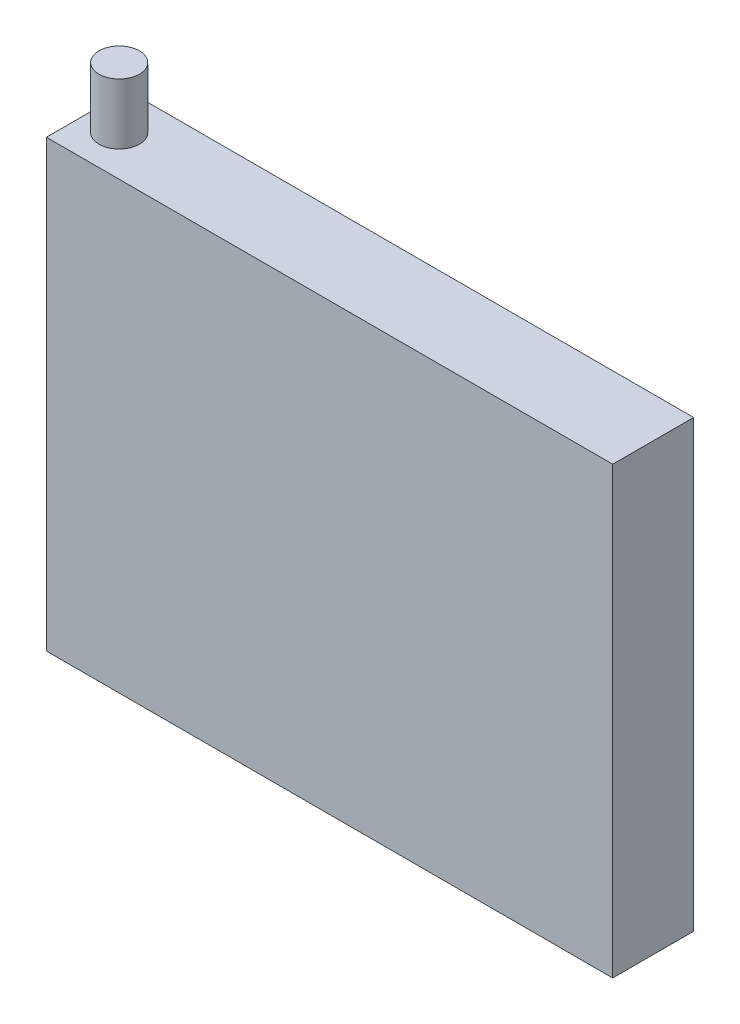
ISO-10303-21;
HEADER;
FILE_DESCRIPTION(('STEP AP214'),'2;1');
FILE_NAME('part.step','',(''),(''),'','','');
FILE_SCHEMA(('AUTOMOTIVE_DESIGN { 1 0 10303 214 1 1 1 1 }'));
ENDSEC;
DATA;
#1=APPLICATION_CONTEXT('core data for automotive mechanical design processes');
#2=APPLICATION_PROTOCOL_DEFINITION('international standard','automotive_design',2000,#1);
#3=PRODUCT_CONTEXT('',#1,'mechanical');
#4=PRODUCT('Part','Part','',(#3));
#5=PRODUCT_RELATED_PRODUCT_CATEGORY('part','',(#4));
#6=PRODUCT_DEFINITION_FORMATION('','',#4);
#7=PRODUCT_DEFINITION_CONTEXT('part definition',#1,'design');
#8=PRODUCT_DEFINITION('design','',#6,#7);
#9=PRODUCT_DEFINITION_SHAPE('','',#8);
#10=(LENGTH_UNIT() NAMED_UNIT(*) SI_UNIT(.MILLI.,.METRE.));
#11=(NAMED_UNIT(*) PLANE_ANGLE_UNIT() SI_UNIT($,.RADIAN.));
#12=(NAMED_UNIT(*) SI_UNIT($,.STERADIAN.) SOLID_ANGLE_UNIT());
#13=UNCERTAINTY_MEASURE_WITH_UNIT(LENGTH_MEASURE(1.E-05),#10,'distance_accuracy_value','');
#14=(GEOMETRIC_REPRESENTATION_CONTEXT(3) GLOBAL_UNCERTAINTY_ASSIGNED_CONTEXT((#13)) GLOBAL_UNIT_ASSIGNED_CONTEXT((#10,
#11,#12)) REPRESENTATION_CONTEXT('',''));
#15=CARTESIAN_POINT('',(0.,0.,0.));
#16=DIRECTION('',(0.,0.,1.));
#17=DIRECTION('',(1.,0.,0.));
#18=AXIS2_PLACEMENT_3D('',#15,#16,#17);
#19=CARTESIAN_POINT('',(35.,-27.5,10.));
#20=DIRECTION('',(-1.,0.,0.));
#21=DIRECTION('',(0.,0.,1.));
#22=AXIS2_PLACEMENT_3D('',#19,#20,#21);
#23=PLANE('',#22);
#24=DIRECTION('',(0.,1.,0.));
#25=VECTOR('',#24,1.);
#26=CARTESIAN_POINT('',(35.,-27.5,0.));
#27=LINE('',#26,#25);
#28=CARTESIAN_POINT('',(35.,-27.5,0.));
#29=VERTEX_POINT('',#28);
#30=CARTESIAN_POINT('',(35.,27.5,0.));
#31=VERTEX_POINT('',#30);
#32=EDGE_CURVE('E101',#29,#31,#27,.T.);
#33=ORIENTED_EDGE('',*,*,#32,.T.);
#34=DIRECTION('',(0.,0.,-1.));
#35=VECTOR('',#34,1.);
#36=CARTESIAN_POINT('',(35.,27.5,10.));
#37=LINE('',#36,#35);
#38=CARTESIAN_POINT('',(35.,27.5,10.));
#39=VERTEX_POINT('',#38);
#40=EDGE_CURVE('E38',#39,#31,#37,.T.);
#41=ORIENTED_EDGE('',*,*,#40,.F.);
#42=DIRECTION('',(0.,1.,0.));
#43=VECTOR('',#42,1.);
#44=CARTESIAN_POINT('',(35.,-27.5,10.));
#45=LINE('',#44,#43);
#46=CARTESIAN_POINT('',(35.,-27.5,10.));
#47=VERTEX_POINT('',#46);
#48=EDGE_CURVE('E88',#47,#39,#45,.T.);
#49=ORIENTED_EDGE('',*,*,#48,.F.);
#50=DIRECTION('',(0.,0.,-1.));
#51=VECTOR('',#50,1.);
#52=CARTESIAN_POINT('',(35.,-27.5,10.));
#53=LINE('',#52,#51);
#54=EDGE_CURVE('E97',#47,#29,#53,.T.);
#55=ORIENTED_EDGE('',*,*,#54,.T.);
#56=EDGE_LOOP('',(#33,#41,#49,#55));
#57=FACE_BOUND('',#56,.T.);
#58=ADVANCED_FACE('F35',(#57),#23,.F.);
#59=CARTESIAN_POINT('',(-35.,27.5,10.));
#60=DIRECTION('',(0.,-1.,0.));
#61=DIRECTION('',(0.,0.,-1.));
#62=AXIS2_PLACEMENT_3D('',#59,#60,#61);
#63=PLANE('',#62);
#64=CARTESIAN_POINT('',(-31.,27.5,5.00000000000001));
#65=DIRECTION('',(0.,-1.,0.));
#66=DIRECTION('',(0.,0.,-1.));
#67=AXIS2_PLACEMENT_3D('',#64,#65,#66);
#68=CIRCLE('',#67,2.5);
#69=CARTESIAN_POINT('',(-31.,27.5,2.50000000000001));
#70=VERTEX_POINT('',#69);
#71=EDGE_CURVE('E11',#70,#70,#68,.F.);
#72=ORIENTED_EDGE('',*,*,#71,.F.);
#73=EDGE_LOOP('',(#72));
#74=FACE_BOUND('',#73,.T.);
#75=DIRECTION('',(-1.,0.,0.));
#76=VECTOR('',#75,1.);
#77=CARTESIAN_POINT('',(-35.,27.5,0.));
#78=LINE('',#77,#76);
#79=CARTESIAN_POINT('',(-35.,27.5,0.));
#80=VERTEX_POINT('',#79);
#81=EDGE_CURVE('E93',#31,#80,#78,.T.);
#82=ORIENTED_EDGE('',*,*,#81,.T.);
#83=DIRECTION('',(0.,0.,-1.));
#84=VECTOR('',#83,1.);
#85=CARTESIAN_POINT('',(-35.,27.5,10.));
#86=LINE('',#85,#84);
#87=CARTESIAN_POINT('',(-35.,27.5,10.));
#88=VERTEX_POINT('',#87);
#89=EDGE_CURVE('E91',#88,#80,#86,.T.);
#90=ORIENTED_EDGE('',*,*,#89,.F.);
#91=DIRECTION('',(-1.,0.,0.));
#92=VECTOR('',#91,1.);
#93=CARTESIAN_POINT('',(-35.,27.5,10.));
#94=LINE('',#93,#92);
#95=EDGE_CURVE('E83',#39,#88,#94,.T.);
#96=ORIENTED_EDGE('',*,*,#95,.F.);
#97=ORIENTED_EDGE('',*,*,#40,.T.);
#98=EDGE_LOOP('',(#82,#90,#96,#97));
#99=FACE_BOUND('',#98,.T.);
#100=ADVANCED_FACE('F92',(#74,#99),#63,.F.);
#101=CARTESIAN_POINT('',(-35.,-27.5,10.));
#102=DIRECTION('',(1.,0.,0.));
#103=DIRECTION('',(0.,0.,-1.));
#104=AXIS2_PLACEMENT_3D('',#101,#102,#103);
#105=PLANE('',#104);
#106=DIRECTION('',(0.,-1.,0.));
#107=VECTOR('',#106,1.);
#108=CARTESIAN_POINT('',(-35.,-27.5,0.));
#109=LINE('',#108,#107);
#110=CARTESIAN_POINT('',(-35.,-27.5,0.));
#111=VERTEX_POINT('',#110);
#112=EDGE_CURVE('E69',#80,#111,#109,.T.);
#113=ORIENTED_EDGE('',*,*,#112,.T.);
#114=DIRECTION('',(0.,0.,-1.));
#115=VECTOR('',#114,1.);
#116=CARTESIAN_POINT('',(-35.,-27.5,10.));
#117=LINE('',#116,#115);
#118=CARTESIAN_POINT('',(-35.,-27.5,10.));
#119=VERTEX_POINT('',#118);
#120=EDGE_CURVE('E94',#119,#111,#117,.T.);
#121=ORIENTED_EDGE('',*,*,#120,.F.);
#122=DIRECTION('',(0.,-1.,0.));
#123=VECTOR('',#122,1.);
#124=CARTESIAN_POINT('',(-35.,-27.5,10.));
#125=LINE('',#124,#123);
#126=EDGE_CURVE('E86',#88,#119,#125,.T.);
#127=ORIENTED_EDGE('',*,*,#126,.F.);
#128=ORIENTED_EDGE('',*,*,#89,.T.);
#129=EDGE_LOOP('',(#113,#121,#127,#128));
#130=FACE_BOUND('',#129,.T.);
#131=ADVANCED_FACE('F95',(#130),#105,.F.);
#132=CARTESIAN_POINT('',(-35.,-27.5,10.));
#133=DIRECTION('',(0.,1.,0.));
#134=DIRECTION('',(0.,0.,1.));
#135=AXIS2_PLACEMENT_3D('',#132,#133,#134);
#136=PLANE('',#135);
#137=CARTESIAN_POINT('',(-31.,-27.5,5.00000000000001));
#138=DIRECTION('',(0.,1.,0.));
#139=DIRECTION('',(0.,0.,1.));
#140=AXIS2_PLACEMENT_3D('',#137,#138,#139);
#141=CIRCLE('',#140,2.5);
#142=CARTESIAN_POINT('',(-31.,-27.5,7.50000000000001));
#143=VERTEX_POINT('',#142);
#144=EDGE_CURVE('E117',#143,#143,#141,.T.);
#145=ORIENTED_EDGE('',*,*,#144,.T.);
#146=EDGE_LOOP('',(#145));
#147=FACE_BOUND('',#146,.T.);
#148=DIRECTION('',(1.,0.,0.));
#149=VECTOR('',#148,1.);
#150=CARTESIAN_POINT('',(-35.,-27.5,0.));
#151=LINE('',#150,#149);
#152=EDGE_CURVE('E75',#111,#29,#151,.T.);
#153=ORIENTED_EDGE('',*,*,#152,.T.);
#154=ORIENTED_EDGE('',*,*,#54,.F.);
#155=DIRECTION('',(1.,0.,0.));
#156=VECTOR('',#155,1.);
#157=CARTESIAN_POINT('',(-35.,-27.5,10.));
#158=LINE('',#157,#156);
#159=EDGE_CURVE('E52',#119,#47,#158,.T.);
#160=ORIENTED_EDGE('',*,*,#159,.F.);
#161=ORIENTED_EDGE('',*,*,#120,.T.);
#162=EDGE_LOOP('',(#153,#154,#160,#161));
#163=FACE_BOUND('',#162,.T.);
#164=ADVANCED_FACE('F109',(#147,#163),#136,.F.);
#165=CARTESIAN_POINT('',(0.,0.,10.));
#166=DIRECTION('',(0.,0.,-1.));
#167=DIRECTION('',(-1.,0.,0.));
#168=AXIS2_PLACEMENT_3D('',#165,#166,#167);
#169=PLANE('',#168);
#170=ORIENTED_EDGE('',*,*,#48,.T.);
#171=ORIENTED_EDGE('',*,*,#95,.T.);
#172=ORIENTED_EDGE('',*,*,#126,.T.);
#173=ORIENTED_EDGE('',*,*,#159,.T.);
#174=EDGE_LOOP('',(#170,#171,#172,#173));
#175=FACE_BOUND('',#174,.T.);
#176=ADVANCED_FACE('F84',(#175),#169,.F.);
#177=CARTESIAN_POINT('',(0.,0.,0.));
#178=DIRECTION('',(0.,0.,-1.));
#179=DIRECTION('',(-1.,0.,0.));
#180=AXIS2_PLACEMENT_3D('',#177,#178,#179);
#181=PLANE('',#180);
#182=ORIENTED_EDGE('',*,*,#32,.F.);
#183=ORIENTED_EDGE('',*,*,#152,.F.);
#184=ORIENTED_EDGE('',*,*,#112,.F.);
#185=ORIENTED_EDGE('',*,*,#81,.F.);
#186=EDGE_LOOP('',(#182,#183,#184,#185));
#187=FACE_BOUND('',#186,.T.);
#188=ADVANCED_FACE('F112',(#187),#181,.T.);
#189=CARTESIAN_POINT('',(-31.,35.,5.00000000000001));
#190=DIRECTION('',(0.,-1.,0.));
#191=DIRECTION('',(0.,0.,-1.));
#192=AXIS2_PLACEMENT_3D('',#189,#190,#191);
#193=CYLINDRICAL_SURFACE('',#192,2.5);
#194=CARTESIAN_POINT('',(-31.,35.,5.00000000000001));
#195=DIRECTION('',(0.,1.,0.));
#196=DIRECTION('',(0.,0.,1.));
#197=AXIS2_PLACEMENT_3D('',#194,#195,#196);
#198=CIRCLE('',#197,2.5);
#199=CARTESIAN_POINT('',(-31.,35.,7.50000000000001));
#200=VERTEX_POINT('',#199);
#201=EDGE_CURVE('E104',#200,#200,#198,.T.);
#202=ORIENTED_EDGE('',*,*,#201,.F.);
#203=EDGE_LOOP('',(#202));
#204=FACE_BOUND('',#203,.T.);
#205=ORIENTED_EDGE('',*,*,#71,.T.);
#206=EDGE_LOOP('',(#205));
#207=FACE_BOUND('',#206,.T.);
#208=ADVANCED_FACE('F151',(#204,#207),#193,.T.);
#209=CARTESIAN_POINT('',(-31.,35.,5.00000000000001));
#210=DIRECTION('',(0.,1.,0.));
#211=DIRECTION('',(0.,0.,1.));
#212=AXIS2_PLACEMENT_3D('',#209,#210,#211);
#213=PLANE('',#212);
#214=ORIENTED_EDGE('',*,*,#201,.T.);
#215=EDGE_LOOP('',(#214));
#216=FACE_BOUND('',#215,.T.);
#217=ADVANCED_FACE('F129',(#216),#213,.T.);
#218=CARTESIAN_POINT('',(-31.,-25.,5.00000000000001));
#219=DIRECTION('',(0.,-1.,0.));
#220=DIRECTION('',(0.,0.,-1.));
#221=AXIS2_PLACEMENT_3D('',#218,#219,#220);
#222=CYLINDRICAL_SURFACE('',#221,2.5);
#223=CARTESIAN_POINT('',(-31.,-25.,5.00000000000001));
#224=DIRECTION('',(0.,-1.,0.));
#225=DIRECTION('',(0.,0.,-1.));
#226=AXIS2_PLACEMENT_3D('',#223,#224,#225);
#227=CIRCLE('',#226,2.5);
#228=CARTESIAN_POINT('',(-31.,-25.,2.50000000000001));
#229=VERTEX_POINT('',#228);
#230=EDGE_CURVE('E120',#229,#229,#227,.T.);
#231=ORIENTED_EDGE('',*,*,#230,.F.);
#232=EDGE_LOOP('',(#231));
#233=FACE_BOUND('',#232,.T.);
#234=ORIENTED_EDGE('',*,*,#144,.F.);
#235=EDGE_LOOP('',(#234));
#236=FACE_BOUND('',#235,.T.);
#237=ADVANCED_FACE('F126',(#233,#236),#222,.F.);
#238=CARTESIAN_POINT('',(-31.,-25.,5.00000000000001));
#239=DIRECTION('',(0.,-1.,0.));
#240=DIRECTION('',(0.,0.,-1.));
#241=AXIS2_PLACEMENT_3D('',#238,#239,#240);
#242=PLANE('',#241);
#243=ORIENTED_EDGE('',*,*,#230,.T.);
#244=EDGE_LOOP('',(#243));
#245=FACE_BOUND('',#244,.T.);
#246=ADVANCED_FACE('F124',(#245),#242,.T.);
#247=CLOSED_SHELL('',(#58,#100,#131,#164,#176,#188,#208,#217,#237,#246));
#248=MANIFOLD_SOLID_BREP('B2',#247);
#249=ADVANCED_BREP_SHAPE_REPRESENTATION('',(#18,#248),#14);
#250=SHAPE_DEFINITION_REPRESENTATION(#9,#249);
ENDSEC;
END-ISO-10303-21;
